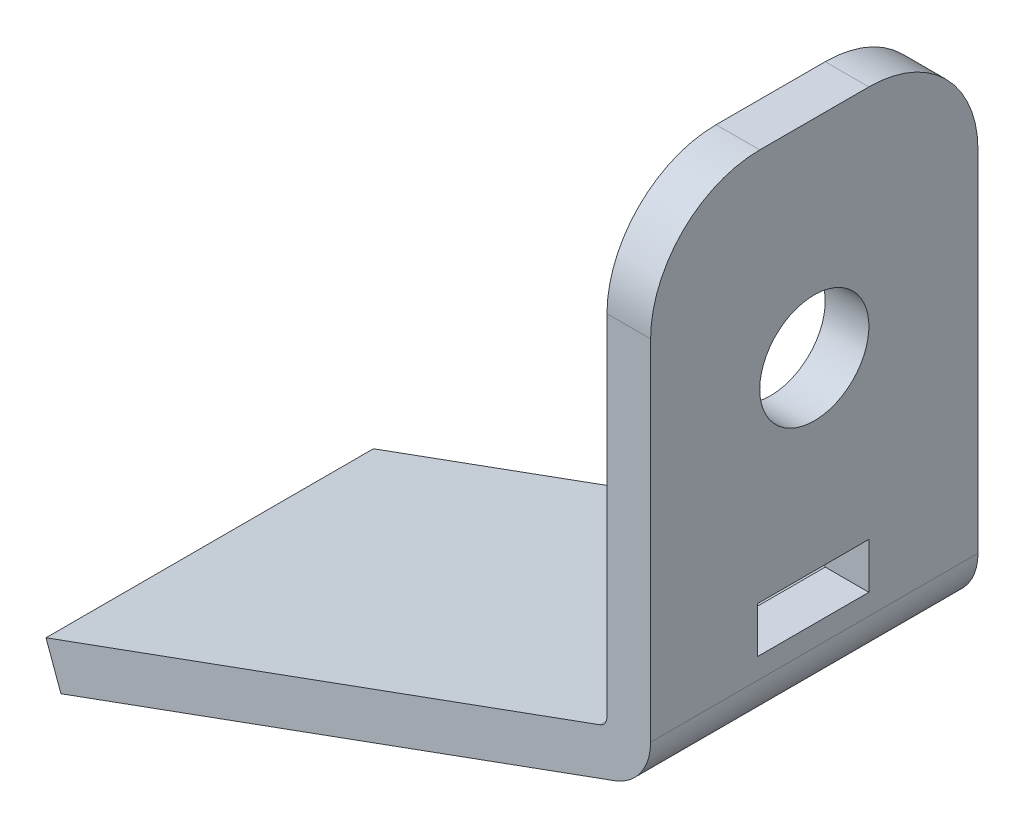
ISO-10303-21;
HEADER;
FILE_DESCRIPTION(('STEP AP214'),'2;1');
FILE_NAME('part.step','',(''),(''),'','','');
FILE_SCHEMA(('AUTOMOTIVE_DESIGN { 1 0 10303 214 1 1 1 1 }'));
ENDSEC;
DATA;
#1=APPLICATION_CONTEXT('core data for automotive mechanical design processes');
#2=APPLICATION_PROTOCOL_DEFINITION('international standard','automotive_design',2000,#1);
#3=PRODUCT_CONTEXT('',#1,'mechanical');
#4=PRODUCT('Part','Part','',(#3));
#5=PRODUCT_RELATED_PRODUCT_CATEGORY('part','',(#4));
#6=PRODUCT_DEFINITION_FORMATION('','',#4);
#7=PRODUCT_DEFINITION_CONTEXT('part definition',#1,'design');
#8=PRODUCT_DEFINITION('design','',#6,#7);
#9=PRODUCT_DEFINITION_SHAPE('','',#8);
#10=(LENGTH_UNIT() NAMED_UNIT(*) SI_UNIT(.MILLI.,.METRE.));
#11=(NAMED_UNIT(*) PLANE_ANGLE_UNIT() SI_UNIT($,.RADIAN.));
#12=(NAMED_UNIT(*) SI_UNIT($,.STERADIAN.) SOLID_ANGLE_UNIT());
#13=UNCERTAINTY_MEASURE_WITH_UNIT(LENGTH_MEASURE(1.E-05),#10,'distance_accuracy_value','');
#14=(GEOMETRIC_REPRESENTATION_CONTEXT(3) GLOBAL_UNCERTAINTY_ASSIGNED_CONTEXT((#13)) GLOBAL_UNIT_ASSIGNED_CONTEXT((#10,
#11,#12)) REPRESENTATION_CONTEXT('',''));
#15=CARTESIAN_POINT('',(0.,0.,0.));
#16=DIRECTION('',(0.,0.,1.));
#17=DIRECTION('',(1.,0.,0.));
#18=AXIS2_PLACEMENT_3D('',#15,#16,#17);
#19=CARTESIAN_POINT('',(2.00000000000001,-376.322980187255,15.));
#20=DIRECTION('',(1.,0.,0.));
#21=DIRECTION('',(0.,0.,1.));
#22=AXIS2_PLACEMENT_3D('',#19,#20,#21);
#23=PLANE('',#22);
#24=DIRECTION('',(0.,0.,1.));
#25=VECTOR('',#24,1.);
#26=CARTESIAN_POINT('',(2.00000000000001,-375.372980187255,10.1));
#27=LINE('',#26,#25);
#28=CARTESIAN_POINT('',(2.00000000000001,-375.372980187255,5.));
#29=VERTEX_POINT('',#28);
#30=CARTESIAN_POINT('',(2.00000000000001,-375.372980187255,10.1));
#31=VERTEX_POINT('',#30);
#32=EDGE_CURVE('E162',#29,#31,#27,.T.);
#33=ORIENTED_EDGE('',*,*,#32,.T.);
#34=DIRECTION('',(0.,1.,0.));
#35=VECTOR('',#34,1.);
#36=CARTESIAN_POINT('',(2.00000000000001,-375.372980187255,10.1));
#37=LINE('',#36,#35);
#38=CARTESIAN_POINT('',(2.00000000000001,-373.272980187255,10.1));
#39=VERTEX_POINT('',#38);
#40=EDGE_CURVE('E142',#31,#39,#37,.T.);
#41=ORIENTED_EDGE('',*,*,#40,.T.);
#42=DIRECTION('',(0.,0.,-1.));
#43=VECTOR('',#42,1.);
#44=CARTESIAN_POINT('',(2.00000000000001,-373.272980187255,10.1));
#45=LINE('',#44,#43);
#46=CARTESIAN_POINT('',(2.00000000000001,-373.272980187255,5.));
#47=VERTEX_POINT('',#46);
#48=EDGE_CURVE('E153',#39,#47,#45,.T.);
#49=ORIENTED_EDGE('',*,*,#48,.T.);
#50=DIRECTION('',(0.,-1.,0.));
#51=VECTOR('',#50,1.);
#52=CARTESIAN_POINT('',(2.00000000000001,-373.272980187255,5.));
#53=LINE('',#52,#51);
#54=EDGE_CURVE('E158',#47,#29,#53,.T.);
#55=ORIENTED_EDGE('',*,*,#54,.T.);
#56=EDGE_LOOP('',(#33,#41,#49,#55));
#57=FACE_BOUND('',#56,.T.);
#58=CARTESIAN_POINT('',(2.00000000000001,-364.820100819106,7.5));
#59=DIRECTION('',(-1.,0.,0.));
#60=DIRECTION('',(0.,0.,1.));
#61=AXIS2_PLACEMENT_3D('',#58,#59,#60);
#62=CIRCLE('',#61,2.5);
#63=CARTESIAN_POINT('',(2.00000000000001,-364.820100819106,10.));
#64=VERTEX_POINT('',#63);
#65=EDGE_CURVE('E169',#64,#64,#62,.T.);
#66=ORIENTED_EDGE('',*,*,#65,.T.);
#67=EDGE_LOOP('',(#66));
#68=FACE_BOUND('',#67,.T.);
#69=DIRECTION('',(0.,0.,-1.));
#70=VECTOR('',#69,1.);
#71=CARTESIAN_POINT('',(2.00000000000001,-355.320100819106,15.));
#72=LINE('',#71,#70);
#73=CARTESIAN_POINT('',(2.00000000000001,-355.320100819106,10.));
#74=VERTEX_POINT('',#73);
#75=CARTESIAN_POINT('',(2.00000000000001,-355.320100819106,5.));
#76=VERTEX_POINT('',#75);
#77=EDGE_CURVE('E190',#74,#76,#72,.T.);
#78=ORIENTED_EDGE('',*,*,#77,.F.);
#79=CARTESIAN_POINT('',(2.00000000000001,-360.320100819106,10.));
#80=DIRECTION('',(-1.,0.,0.));
#81=DIRECTION('',(0.,0.,1.));
#82=AXIS2_PLACEMENT_3D('',#79,#80,#81);
#83=CIRCLE('',#82,5.);
#84=CARTESIAN_POINT('',(2.00000000000001,-360.320100819106,15.));
#85=VERTEX_POINT('',#84);
#86=EDGE_CURVE('E248',#85,#74,#83,.T.);
#87=ORIENTED_EDGE('',*,*,#86,.F.);
#88=DIRECTION('',(0.,1.,0.));
#89=VECTOR('',#88,1.);
#90=CARTESIAN_POINT('',(2.00000000000001,-375.320100819106,15.));
#91=LINE('',#90,#89);
#92=CARTESIAN_POINT('',(2.00000000000002,-376.322980187255,15.));
#93=VERTEX_POINT('',#92);
#94=EDGE_CURVE('E175',#93,#85,#91,.T.);
#95=ORIENTED_EDGE('',*,*,#94,.F.);
#96=DIRECTION('',(0.,0.,-1.));
#97=VECTOR('',#96,1.);
#98=CARTESIAN_POINT('',(2.00000000000002,-376.322980187255,15.));
#99=LINE('',#98,#97);
#100=CARTESIAN_POINT('',(2.00000000000002,-376.322980187255,0.));
#101=VERTEX_POINT('',#100);
#102=EDGE_CURVE('E205',#93,#101,#99,.T.);
#103=ORIENTED_EDGE('',*,*,#102,.T.);
#104=DIRECTION('',(0.,1.,0.));
#105=VECTOR('',#104,1.);
#106=CARTESIAN_POINT('',(2.00000000000001,-376.322980187255,0.));
#107=LINE('',#106,#105);
#108=CARTESIAN_POINT('',(2.00000000000001,-360.320100819106,0.));
#109=VERTEX_POINT('',#108);
#110=EDGE_CURVE('E178',#101,#109,#107,.T.);
#111=ORIENTED_EDGE('',*,*,#110,.T.);
#112=CARTESIAN_POINT('',(2.00000000000001,-360.320100819106,5.));
#113=DIRECTION('',(-1.,0.,0.));
#114=DIRECTION('',(0.,0.,1.));
#115=AXIS2_PLACEMENT_3D('',#112,#113,#114);
#116=CIRCLE('',#115,5.);
#117=EDGE_CURVE('E45',#76,#109,#116,.T.);
#118=ORIENTED_EDGE('',*,*,#117,.F.);
#119=EDGE_LOOP('',(#78,#87,#95,#103,#111,#118));
#120=FACE_BOUND('',#119,.T.);
#121=ADVANCED_FACE('F37',(#57,#68,#120),#23,.T.);
#122=CARTESIAN_POINT('',(-0.499999999999992,-376.322980187255,15.));
#123=DIRECTION('',(0.,0.,-1.));
#124=DIRECTION('',(1.,0.,0.));
#125=AXIS2_PLACEMENT_3D('',#122,#123,#124);
#126=CYLINDRICAL_SURFACE('',#125,2.50000000000002);
#127=CARTESIAN_POINT('',(-0.499999999999992,-376.322980187255,0.));
#128=DIRECTION('',(0.,0.,1.));
#129=DIRECTION('',(1.,0.,0.));
#130=AXIS2_PLACEMENT_3D('',#127,#128,#129);
#131=CIRCLE('',#130,2.50000000000002);
#132=CARTESIAN_POINT('',(0.355050358314159,-378.67221173922,0.));
#133=VERTEX_POINT('',#132);
#134=EDGE_CURVE('E201',#133,#101,#131,.T.);
#135=ORIENTED_EDGE('',*,*,#134,.T.);
#136=ORIENTED_EDGE('',*,*,#102,.F.);
#137=CARTESIAN_POINT('',(-0.499999999999992,-376.322980187255,15.));
#138=DIRECTION('',(0.,0.,1.));
#139=DIRECTION('',(1.,0.,0.));
#140=AXIS2_PLACEMENT_3D('',#137,#138,#139);
#141=CIRCLE('',#140,2.50000000000002);
#142=CARTESIAN_POINT('',(0.355050358314159,-378.67221173922,15.));
#143=VERTEX_POINT('',#142);
#144=EDGE_CURVE('E188',#143,#93,#141,.T.);
#145=ORIENTED_EDGE('',*,*,#144,.F.);
#146=DIRECTION('',(0.,0.,-1.));
#147=VECTOR('',#146,1.);
#148=CARTESIAN_POINT('',(0.355050358314159,-378.67221173922,15.));
#149=LINE('',#148,#147);
#150=EDGE_CURVE('E208',#143,#133,#149,.T.);
#151=ORIENTED_EDGE('',*,*,#150,.T.);
#152=EDGE_LOOP('',(#135,#136,#145,#151));
#153=FACE_BOUND('',#152,.T.);
#154=ADVANCED_FACE('F284',(#153),#126,.T.);
#155=CARTESIAN_POINT('',(0.355050358314159,-378.67221173922,15.));
#156=DIRECTION('',(0.342020143325658,-0.939692620785912,0.));
#157=DIRECTION('',(0.939692620785912,0.342020143325658,0.));
#158=AXIS2_PLACEMENT_3D('',#155,#156,#157);
#159=PLANE('',#158);
#160=DIRECTION('',(0.939692620785912,0.342020143325658,0.));
#161=VECTOR('',#160,1.);
#162=CARTESIAN_POINT('',(0.355050358314159,-378.67221173922,0.));
#163=LINE('',#162,#161);
#164=CARTESIAN_POINT('',(-25.0166504029055,-387.906755609013,0.));
#165=VERTEX_POINT('',#164);
#166=EDGE_CURVE('E199',#165,#133,#163,.T.);
#167=ORIENTED_EDGE('',*,*,#166,.T.);
#168=ORIENTED_EDGE('',*,*,#150,.F.);
#169=DIRECTION('',(0.939692620785912,0.342020143325658,0.));
#170=VECTOR('',#169,1.);
#171=CARTESIAN_POINT('',(0.355050358314159,-378.67221173922,15.));
#172=LINE('',#171,#170);
#173=CARTESIAN_POINT('',(-25.0166504029055,-387.906755609013,15.));
#174=VERTEX_POINT('',#173);
#175=EDGE_CURVE('E186',#174,#143,#172,.T.);
#176=ORIENTED_EDGE('',*,*,#175,.F.);
#177=DIRECTION('',(0.,0.,-1.));
#178=VECTOR('',#177,1.);
#179=CARTESIAN_POINT('',(-25.0166504029055,-387.906755609013,15.));
#180=LINE('',#179,#178);
#181=EDGE_CURVE('E211',#174,#165,#180,.T.);
#182=ORIENTED_EDGE('',*,*,#181,.T.);
#183=EDGE_LOOP('',(#167,#168,#176,#182));
#184=FACE_BOUND('',#183,.T.);
#185=ADVANCED_FACE('F286',(#184),#159,.T.);
#186=CARTESIAN_POINT('',(-25.0166504029055,-387.906755609013,15.));
#187=DIRECTION('',(-0.939692620785913,-0.342020143325657,0.));
#188=DIRECTION('',(0.342020143325657,-0.939692620785913,0.));
#189=AXIS2_PLACEMENT_3D('',#186,#187,#188);
#190=PLANE('',#189);
#191=DIRECTION('',(0.342020143325657,-0.939692620785913,0.));
#192=VECTOR('',#191,1.);
#193=CARTESIAN_POINT('',(-25.0166504029055,-387.906755609013,0.));
#194=LINE('',#193,#192);
#195=CARTESIAN_POINT('',(-25.7006906895567,-386.027370367441,0.));
#196=VERTEX_POINT('',#195);
#197=EDGE_CURVE('E197',#196,#165,#194,.T.);
#198=ORIENTED_EDGE('',*,*,#197,.T.);
#199=ORIENTED_EDGE('',*,*,#181,.F.);
#200=DIRECTION('',(0.342020143325657,-0.939692620785913,0.));
#201=VECTOR('',#200,1.);
#202=CARTESIAN_POINT('',(-25.0166504029055,-387.906755609013,15.));
#203=LINE('',#202,#201);
#204=CARTESIAN_POINT('',(-25.7006906895567,-386.027370367441,15.));
#205=VERTEX_POINT('',#204);
#206=EDGE_CURVE('E184',#205,#174,#203,.T.);
#207=ORIENTED_EDGE('',*,*,#206,.F.);
#208=DIRECTION('',(0.,0.,-1.));
#209=VECTOR('',#208,1.);
#210=CARTESIAN_POINT('',(-25.7006906895567,-386.027370367441,15.));
#211=LINE('',#210,#209);
#212=EDGE_CURVE('E214',#205,#196,#211,.T.);
#213=ORIENTED_EDGE('',*,*,#212,.T.);
#214=EDGE_LOOP('',(#198,#199,#207,#213));
#215=FACE_BOUND('',#214,.T.);
#216=ADVANCED_FACE('F290',(#215),#190,.T.);
#217=CARTESIAN_POINT('',(-0.328989928337184,-376.792826497648,15.));
#218=DIRECTION('',(-0.342020143325669,0.939692620785908,0.));
#219=DIRECTION('',(-0.939692620785908,-0.342020143325669,0.));
#220=AXIS2_PLACEMENT_3D('',#217,#218,#219);
#221=PLANE('',#220);
#222=DIRECTION('',(-0.939692620785908,-0.342020143325669,0.));
#223=VECTOR('',#222,1.);
#224=CARTESIAN_POINT('',(-0.328989928337184,-376.792826497648,0.));
#225=LINE('',#224,#223);
#226=CARTESIAN_POINT('',(-0.328989928337175,-376.792826497648,0.));
#227=VERTEX_POINT('',#226);
#228=EDGE_CURVE('E195',#227,#196,#225,.T.);
#229=ORIENTED_EDGE('',*,*,#228,.T.);
#230=ORIENTED_EDGE('',*,*,#212,.F.);
#231=DIRECTION('',(-0.939692620785908,-0.342020143325669,0.));
#232=VECTOR('',#231,1.);
#233=CARTESIAN_POINT('',(-0.328989928337184,-376.792826497648,15.));
#234=LINE('',#233,#232);
#235=CARTESIAN_POINT('',(-0.328989928337175,-376.792826497648,15.));
#236=VERTEX_POINT('',#235);
#237=EDGE_CURVE('E182',#236,#205,#234,.T.);
#238=ORIENTED_EDGE('',*,*,#237,.F.);
#239=DIRECTION('',(0.,0.,-1.));
#240=VECTOR('',#239,1.);
#241=CARTESIAN_POINT('',(-0.328989928337175,-376.792826497648,15.));
#242=LINE('',#241,#240);
#243=EDGE_CURVE('E217',#236,#227,#242,.T.);
#244=ORIENTED_EDGE('',*,*,#243,.T.);
#245=EDGE_LOOP('',(#229,#230,#238,#244));
#246=FACE_BOUND('',#245,.T.);
#247=ADVANCED_FACE('F293',(#246),#221,.T.);
#248=CARTESIAN_POINT('',(-0.5,-376.322980187255,15.));
#249=DIRECTION('',(0.,0.,-1.));
#250=DIRECTION('',(1.,0.,0.));
#251=AXIS2_PLACEMENT_3D('',#248,#249,#250);
#252=CYLINDRICAL_SURFACE('',#251,0.499999999999985);
#253=CARTESIAN_POINT('',(-0.5,-376.322980187255,0.));
#254=DIRECTION('',(0.,0.,-1.));
#255=DIRECTION('',(-1.,0.,0.));
#256=AXIS2_PLACEMENT_3D('',#253,#254,#255);
#257=CIRCLE('',#256,0.499999999999985);
#258=CARTESIAN_POINT('',(0.,-376.322980187255,0.));
#259=VERTEX_POINT('',#258);
#260=EDGE_CURVE('E193',#259,#227,#257,.T.);
#261=ORIENTED_EDGE('',*,*,#260,.T.);
#262=ORIENTED_EDGE('',*,*,#243,.F.);
#263=CARTESIAN_POINT('',(-0.5,-376.322980187255,15.));
#264=DIRECTION('',(0.,0.,-1.));
#265=DIRECTION('',(-1.,0.,0.));
#266=AXIS2_PLACEMENT_3D('',#263,#264,#265);
#267=CIRCLE('',#266,0.499999999999985);
#268=CARTESIAN_POINT('',(0.,-376.322980187255,15.));
#269=VERTEX_POINT('',#268);
#270=EDGE_CURVE('E180',#269,#236,#267,.T.);
#271=ORIENTED_EDGE('',*,*,#270,.F.);
#272=DIRECTION('',(0.,0.,-1.));
#273=VECTOR('',#272,1.);
#274=CARTESIAN_POINT('',(0.,-376.322980187255,15.));
#275=LINE('',#274,#273);
#276=EDGE_CURVE('E220',#269,#259,#275,.T.);
#277=ORIENTED_EDGE('',*,*,#276,.T.);
#278=EDGE_LOOP('',(#261,#262,#271,#277));
#279=FACE_BOUND('',#278,.T.);
#280=ADVANCED_FACE('F269',(#279),#252,.F.);
#281=CARTESIAN_POINT('',(0.,-375.320100819106,15.));
#282=DIRECTION('',(-1.,0.,0.));
#283=DIRECTION('',(0.,-1.,0.));
#284=AXIS2_PLACEMENT_3D('',#281,#282,#283);
#285=PLANE('',#284);
#286=DIRECTION('',(0.,0.,-1.));
#287=VECTOR('',#286,1.);
#288=CARTESIAN_POINT('',(0.,-375.372980187255,15.));
#289=LINE('',#288,#287);
#290=CARTESIAN_POINT('',(0.,-375.372980187255,10.1));
#291=VERTEX_POINT('',#290);
#292=CARTESIAN_POINT('',(0.,-375.372980187255,5.));
#293=VERTEX_POINT('',#292);
#294=EDGE_CURVE('E236',#291,#293,#289,.T.);
#295=ORIENTED_EDGE('',*,*,#294,.T.);
#296=DIRECTION('',(0.,1.,0.));
#297=VECTOR('',#296,1.);
#298=CARTESIAN_POINT('',(0.,-375.320100819106,5.));
#299=LINE('',#298,#297);
#300=CARTESIAN_POINT('',(0.,-373.272980187255,5.));
#301=VERTEX_POINT('',#300);
#302=EDGE_CURVE('E233',#293,#301,#299,.T.);
#303=ORIENTED_EDGE('',*,*,#302,.T.);
#304=DIRECTION('',(0.,0.,1.));
#305=VECTOR('',#304,1.);
#306=CARTESIAN_POINT('',(0.,-373.272980187255,15.));
#307=LINE('',#306,#305);
#308=CARTESIAN_POINT('',(0.,-373.272980187255,10.1));
#309=VERTEX_POINT('',#308);
#310=EDGE_CURVE('E231',#301,#309,#307,.T.);
#311=ORIENTED_EDGE('',*,*,#310,.T.);
#312=DIRECTION('',(0.,-1.,0.));
#313=VECTOR('',#312,1.);
#314=CARTESIAN_POINT('',(0.,-375.320100819106,10.1));
#315=LINE('',#314,#313);
#316=EDGE_CURVE('E145',#309,#291,#315,.T.);
#317=ORIENTED_EDGE('',*,*,#316,.T.);
#318=EDGE_LOOP('',(#295,#303,#311,#317));
#319=FACE_BOUND('',#318,.T.);
#320=CARTESIAN_POINT('',(0.,-364.820100819106,7.5));
#321=DIRECTION('',(1.,0.,0.));
#322=DIRECTION('',(0.,-1.,0.));
#323=AXIS2_PLACEMENT_3D('',#320,#321,#322);
#324=CIRCLE('',#323,2.5);
#325=CARTESIAN_POINT('',(0.,-367.320100819106,7.5));
#326=VERTEX_POINT('',#325);
#327=EDGE_CURVE('E174',#326,#326,#324,.T.);
#328=ORIENTED_EDGE('',*,*,#327,.T.);
#329=EDGE_LOOP('',(#328));
#330=FACE_BOUND('',#329,.T.);
#331=DIRECTION('',(0.,-1.,0.));
#332=VECTOR('',#331,1.);
#333=CARTESIAN_POINT('',(0.,-375.320100819106,0.));
#334=LINE('',#333,#332);
#335=CARTESIAN_POINT('',(0.,-360.320100819106,0.));
#336=VERTEX_POINT('',#335);
#337=EDGE_CURVE('E191',#336,#259,#334,.T.);
#338=ORIENTED_EDGE('',*,*,#337,.T.);
#339=ORIENTED_EDGE('',*,*,#276,.F.);
#340=DIRECTION('',(0.,-1.,0.));
#341=VECTOR('',#340,1.);
#342=CARTESIAN_POINT('',(0.,-355.320100819106,15.));
#343=LINE('',#342,#341);
#344=CARTESIAN_POINT('',(0.,-360.320100819106,15.));
#345=VERTEX_POINT('',#344);
#346=EDGE_CURVE('E177',#345,#269,#343,.T.);
#347=ORIENTED_EDGE('',*,*,#346,.F.);
#348=CARTESIAN_POINT('',(0.,-360.320100819106,10.));
#349=DIRECTION('',(1.,0.,0.));
#350=DIRECTION('',(0.,-1.,0.));
#351=AXIS2_PLACEMENT_3D('',#348,#349,#350);
#352=CIRCLE('',#351,5.);
#353=CARTESIAN_POINT('',(0.,-355.320100819106,10.));
#354=VERTEX_POINT('',#353);
#355=EDGE_CURVE('E241',#354,#345,#352,.T.);
#356=ORIENTED_EDGE('',*,*,#355,.F.);
#357=DIRECTION('',(0.,0.,-1.));
#358=VECTOR('',#357,1.);
#359=CARTESIAN_POINT('',(0.,-355.320100819106,15.));
#360=LINE('',#359,#358);
#361=CARTESIAN_POINT('',(0.,-355.320100819106,5.));
#362=VERTEX_POINT('',#361);
#363=EDGE_CURVE('E223',#354,#362,#360,.T.);
#364=ORIENTED_EDGE('',*,*,#363,.T.);
#365=CARTESIAN_POINT('',(0.,-360.320100819106,5.));
#366=DIRECTION('',(1.,0.,0.));
#367=DIRECTION('',(0.,-1.,0.));
#368=AXIS2_PLACEMENT_3D('',#365,#366,#367);
#369=CIRCLE('',#368,5.);
#370=EDGE_CURVE('E243',#336,#362,#369,.T.);
#371=ORIENTED_EDGE('',*,*,#370,.F.);
#372=EDGE_LOOP('',(#338,#339,#347,#356,#364,#371));
#373=FACE_BOUND('',#372,.T.);
#374=ADVANCED_FACE('F265',(#319,#330,#373),#285,.T.);
#375=CARTESIAN_POINT('',(2.00000000000001,-355.320100819106,15.));
#376=DIRECTION('',(0.,1.,0.));
#377=DIRECTION('',(0.,0.,-1.));
#378=AXIS2_PLACEMENT_3D('',#375,#376,#377);
#379=PLANE('',#378);
#380=ORIENTED_EDGE('',*,*,#363,.F.);
#381=DIRECTION('',(-1.,0.,0.));
#382=VECTOR('',#381,1.);
#383=CARTESIAN_POINT('',(2.00000000000001,-355.320100819106,10.));
#384=LINE('',#383,#382);
#385=EDGE_CURVE('E245',#74,#354,#384,.T.);
#386=ORIENTED_EDGE('',*,*,#385,.F.);
#387=ORIENTED_EDGE('',*,*,#77,.T.);
#388=DIRECTION('',(-1.,0.,0.));
#389=VECTOR('',#388,1.);
#390=CARTESIAN_POINT('',(2.00000000000001,-355.320100819106,5.));
#391=LINE('',#390,#389);
#392=EDGE_CURVE('E58',#362,#76,#391,.F.);
#393=ORIENTED_EDGE('',*,*,#392,.F.);
#394=EDGE_LOOP('',(#380,#386,#387,#393));
#395=FACE_BOUND('',#394,.T.);
#396=ADVANCED_FACE('F279',(#395),#379,.T.);
#397=CARTESIAN_POINT('',(-0.5,-376.322980187255,15.));
#398=DIRECTION('',(0.,0.,1.));
#399=DIRECTION('',(-1.,0.,0.));
#400=AXIS2_PLACEMENT_3D('',#397,#398,#399);
#401=PLANE('',#400);
#402=ORIENTED_EDGE('',*,*,#346,.T.);
#403=ORIENTED_EDGE('',*,*,#270,.T.);
#404=ORIENTED_EDGE('',*,*,#237,.T.);
#405=ORIENTED_EDGE('',*,*,#206,.T.);
#406=ORIENTED_EDGE('',*,*,#175,.T.);
#407=ORIENTED_EDGE('',*,*,#144,.T.);
#408=ORIENTED_EDGE('',*,*,#94,.T.);
#409=DIRECTION('',(-1.,0.,0.));
#410=VECTOR('',#409,1.);
#411=CARTESIAN_POINT('',(-0.5,-360.320100819106,15.));
#412=LINE('',#411,#410);
#413=EDGE_CURVE('E11',#345,#85,#412,.F.);
#414=ORIENTED_EDGE('',*,*,#413,.F.);
#415=EDGE_LOOP('',(#402,#403,#404,#405,#406,#407,#408,#414));
#416=FACE_BOUND('',#415,.T.);
#417=ADVANCED_FACE('F273',(#416),#401,.T.);
#418=CARTESIAN_POINT('',(-0.5,-376.322980187255,0.));
#419=DIRECTION('',(0.,0.,1.));
#420=DIRECTION('',(-1.,0.,0.));
#421=AXIS2_PLACEMENT_3D('',#418,#419,#420);
#422=PLANE('',#421);
#423=ORIENTED_EDGE('',*,*,#110,.F.);
#424=ORIENTED_EDGE('',*,*,#134,.F.);
#425=ORIENTED_EDGE('',*,*,#166,.F.);
#426=ORIENTED_EDGE('',*,*,#197,.F.);
#427=ORIENTED_EDGE('',*,*,#228,.F.);
#428=ORIENTED_EDGE('',*,*,#260,.F.);
#429=ORIENTED_EDGE('',*,*,#337,.F.);
#430=DIRECTION('',(-1.,0.,0.));
#431=VECTOR('',#430,1.);
#432=CARTESIAN_POINT('',(0.,-360.320100819106,0.));
#433=LINE('',#432,#431);
#434=EDGE_CURVE('E239',#109,#336,#433,.T.);
#435=ORIENTED_EDGE('',*,*,#434,.F.);
#436=EDGE_LOOP('',(#423,#424,#425,#426,#427,#428,#429,#435));
#437=FACE_BOUND('',#436,.T.);
#438=ADVANCED_FACE('F258',(#437),#422,.F.);
#439=CARTESIAN_POINT('',(-13.,-364.820100819106,7.5));
#440=DIRECTION('',(1.,0.,0.));
#441=DIRECTION('',(0.,0.,1.));
#442=AXIS2_PLACEMENT_3D('',#439,#440,#441);
#443=CYLINDRICAL_SURFACE('',#442,2.5);
#444=ORIENTED_EDGE('',*,*,#327,.F.);
#445=EDGE_LOOP('',(#444));
#446=FACE_BOUND('',#445,.T.);
#447=ORIENTED_EDGE('',*,*,#65,.F.);
#448=EDGE_LOOP('',(#447));
#449=FACE_BOUND('',#448,.T.);
#450=ADVANCED_FACE('F365',(#446,#449),#443,.F.);
#451=CARTESIAN_POINT('',(-13.,-375.372980187255,10.1));
#452=DIRECTION('',(0.,-1.,0.));
#453=DIRECTION('',(0.,0.,1.));
#454=AXIS2_PLACEMENT_3D('',#451,#452,#453);
#455=PLANE('',#454);
#456=ORIENTED_EDGE('',*,*,#294,.F.);
#457=DIRECTION('',(1.,0.,0.));
#458=VECTOR('',#457,1.);
#459=CARTESIAN_POINT('',(-13.,-375.372980187255,10.1));
#460=LINE('',#459,#458);
#461=EDGE_CURVE('E150',#291,#31,#460,.T.);
#462=ORIENTED_EDGE('',*,*,#461,.T.);
#463=ORIENTED_EDGE('',*,*,#32,.F.);
#464=DIRECTION('',(1.,0.,0.));
#465=VECTOR('',#464,1.);
#466=CARTESIAN_POINT('',(-13.,-375.372980187255,5.));
#467=LINE('',#466,#465);
#468=EDGE_CURVE('E167',#293,#29,#467,.T.);
#469=ORIENTED_EDGE('',*,*,#468,.F.);
#470=EDGE_LOOP('',(#456,#462,#463,#469));
#471=FACE_BOUND('',#470,.T.);
#472=ADVANCED_FACE('F373',(#471),#455,.F.);
#473=CARTESIAN_POINT('',(-13.,-373.272980187255,5.));
#474=DIRECTION('',(0.,0.,-1.));
#475=DIRECTION('',(1.,0.,0.));
#476=AXIS2_PLACEMENT_3D('',#473,#474,#475);
#477=PLANE('',#476);
#478=ORIENTED_EDGE('',*,*,#302,.F.);
#479=ORIENTED_EDGE('',*,*,#468,.T.);
#480=ORIENTED_EDGE('',*,*,#54,.F.);
#481=DIRECTION('',(1.,0.,0.));
#482=VECTOR('',#481,1.);
#483=CARTESIAN_POINT('',(-13.,-373.272980187255,5.));
#484=LINE('',#483,#482);
#485=EDGE_CURVE('E149',#301,#47,#484,.T.);
#486=ORIENTED_EDGE('',*,*,#485,.F.);
#487=EDGE_LOOP('',(#478,#479,#480,#486));
#488=FACE_BOUND('',#487,.T.);
#489=ADVANCED_FACE('F383',(#488),#477,.F.);
#490=CARTESIAN_POINT('',(-13.,-373.272980187255,10.1));
#491=DIRECTION('',(0.,1.,0.));
#492=DIRECTION('',(0.,0.,-1.));
#493=AXIS2_PLACEMENT_3D('',#490,#491,#492);
#494=PLANE('',#493);
#495=ORIENTED_EDGE('',*,*,#310,.F.);
#496=ORIENTED_EDGE('',*,*,#485,.T.);
#497=ORIENTED_EDGE('',*,*,#48,.F.);
#498=DIRECTION('',(1.,0.,0.));
#499=VECTOR('',#498,1.);
#500=CARTESIAN_POINT('',(-13.,-373.272980187255,10.1));
#501=LINE('',#500,#499);
#502=EDGE_CURVE('E138',#309,#39,#501,.T.);
#503=ORIENTED_EDGE('',*,*,#502,.F.);
#504=EDGE_LOOP('',(#495,#496,#497,#503));
#505=FACE_BOUND('',#504,.T.);
#506=ADVANCED_FACE('F154',(#505),#494,.F.);
#507=CARTESIAN_POINT('',(-13.,-375.372980187255,10.1));
#508=DIRECTION('',(0.,0.,1.));
#509=DIRECTION('',(-1.,0.,0.));
#510=AXIS2_PLACEMENT_3D('',#507,#508,#509);
#511=PLANE('',#510);
#512=ORIENTED_EDGE('',*,*,#316,.F.);
#513=ORIENTED_EDGE('',*,*,#502,.T.);
#514=ORIENTED_EDGE('',*,*,#40,.F.);
#515=ORIENTED_EDGE('',*,*,#461,.F.);
#516=EDGE_LOOP('',(#512,#513,#514,#515));
#517=FACE_BOUND('',#516,.T.);
#518=ADVANCED_FACE('F140',(#517),#511,.F.);
#519=CARTESIAN_POINT('',(-0.5,-360.320100819106,5.));
#520=DIRECTION('',(1.,0.,0.));
#521=DIRECTION('',(0.,0.,1.));
#522=AXIS2_PLACEMENT_3D('',#519,#520,#521);
#523=CYLINDRICAL_SURFACE('',#522,5.);
#524=ORIENTED_EDGE('',*,*,#117,.T.);
#525=ORIENTED_EDGE('',*,*,#434,.T.);
#526=ORIENTED_EDGE('',*,*,#370,.T.);
#527=ORIENTED_EDGE('',*,*,#392,.T.);
#528=EDGE_LOOP('',(#524,#525,#526,#527));
#529=FACE_BOUND('',#528,.T.);
#530=ADVANCED_FACE('F249',(#529),#523,.T.);
#531=CARTESIAN_POINT('',(2.00000000000001,-360.320100819106,10.));
#532=DIRECTION('',(-1.,0.,0.));
#533=DIRECTION('',(0.,0.,-1.));
#534=AXIS2_PLACEMENT_3D('',#531,#532,#533);
#535=CYLINDRICAL_SURFACE('',#534,5.);
#536=ORIENTED_EDGE('',*,*,#86,.T.);
#537=ORIENTED_EDGE('',*,*,#385,.T.);
#538=ORIENTED_EDGE('',*,*,#355,.T.);
#539=ORIENTED_EDGE('',*,*,#413,.T.);
#540=EDGE_LOOP('',(#536,#537,#538,#539));
#541=FACE_BOUND('',#540,.T.);
#542=ADVANCED_FACE('F39',(#541),#535,.T.);
#543=CLOSED_SHELL('',(#121,#154,#185,#216,#247,#280,#374,#396,#417,#438,#450,#472,#489,#506,
#518,#530,#542));
#544=MANIFOLD_SOLID_BREP('B2',#543);
#545=ADVANCED_BREP_SHAPE_REPRESENTATION('',(#18,#544),#14);
#546=SHAPE_DEFINITION_REPRESENTATION(#9,#545);
ENDSEC;
END-ISO-10303-21;
